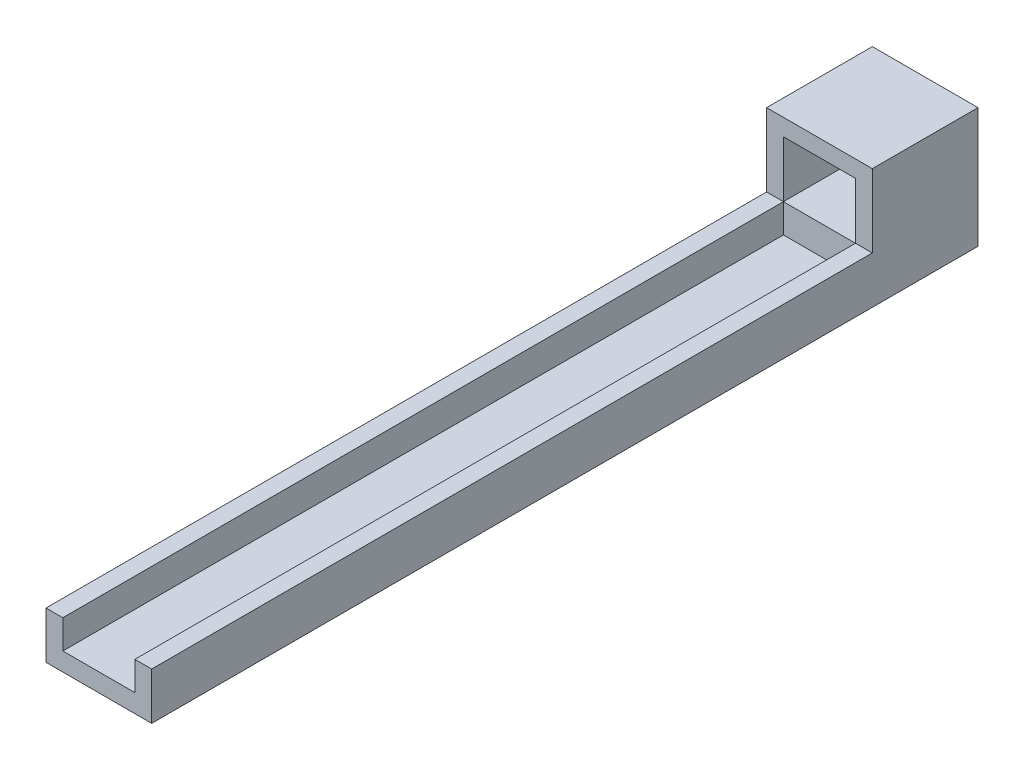
ISO-10303-21;
HEADER;
FILE_DESCRIPTION(('STEP AP214'),'2;1');
FILE_NAME('part.step','',(''),(''),'','','');
FILE_SCHEMA(('AUTOMOTIVE_DESIGN { 1 0 10303 214 1 1 1 1 }'));
ENDSEC;
DATA;
#1=APPLICATION_CONTEXT('core data for automotive mechanical design processes');
#2=APPLICATION_PROTOCOL_DEFINITION('international standard','automotive_design',2000,#1);
#3=PRODUCT_CONTEXT('',#1,'mechanical');
#4=PRODUCT('Part','Part','',(#3));
#5=PRODUCT_RELATED_PRODUCT_CATEGORY('part','',(#4));
#6=PRODUCT_DEFINITION_FORMATION('','',#4);
#7=PRODUCT_DEFINITION_CONTEXT('part definition',#1,'design');
#8=PRODUCT_DEFINITION('design','',#6,#7);
#9=PRODUCT_DEFINITION_SHAPE('','',#8);
#10=(LENGTH_UNIT() NAMED_UNIT(*) SI_UNIT(.MILLI.,.METRE.));
#11=(NAMED_UNIT(*) PLANE_ANGLE_UNIT() SI_UNIT($,.RADIAN.));
#12=(NAMED_UNIT(*) SI_UNIT($,.STERADIAN.) SOLID_ANGLE_UNIT());
#13=UNCERTAINTY_MEASURE_WITH_UNIT(LENGTH_MEASURE(1.E-05),#10,'distance_accuracy_value','');
#14=(GEOMETRIC_REPRESENTATION_CONTEXT(3) GLOBAL_UNCERTAINTY_ASSIGNED_CONTEXT((#13)) GLOBAL_UNIT_ASSIGNED_CONTEXT((#10,
#11,#12)) REPRESENTATION_CONTEXT('',''));
#15=CARTESIAN_POINT('',(0.,0.,0.));
#16=DIRECTION('',(0.,0.,1.));
#17=DIRECTION('',(1.,0.,0.));
#18=AXIS2_PLACEMENT_3D('',#15,#16,#17);
#19=CARTESIAN_POINT('',(-22.1134214303808,-9.7596153846154,22.));
#20=DIRECTION('',(0.,1.,0.));
#21=DIRECTION('',(0.,0.,1.));
#22=AXIS2_PLACEMENT_3D('',#19,#20,#21);
#23=PLANE('',#22);
#24=DIRECTION('',(0.,0.,-1.));
#25=VECTOR('',#24,1.);
#26=CARTESIAN_POINT('',(-7.11342143038084,-9.7596153846154,172.));
#27=LINE('',#26,#25);
#28=CARTESIAN_POINT('',(-7.11342143038084,-9.7596153846154,172.));
#29=VERTEX_POINT('',#28);
#30=CARTESIAN_POINT('',(-7.11342143038084,-9.7596153846154,22.));
#31=VERTEX_POINT('',#30);
#32=EDGE_CURVE('E136',#29,#31,#27,.T.);
#33=ORIENTED_EDGE('',*,*,#32,.F.);
#34=DIRECTION('',(-1.,0.,0.));
#35=VECTOR('',#34,1.);
#36=CARTESIAN_POINT('',(-3.61342143038084,-9.7596153846154,172.));
#37=LINE('',#36,#35);
#38=CARTESIAN_POINT('',(-3.61342143038084,-9.7596153846154,172.));
#39=VERTEX_POINT('',#38);
#40=EDGE_CURVE('E168',#39,#29,#37,.T.);
#41=ORIENTED_EDGE('',*,*,#40,.F.);
#42=DIRECTION('',(0.,0.,-1.));
#43=VECTOR('',#42,1.);
#44=CARTESIAN_POINT('',(-3.61342143038084,-9.7596153846154,172.));
#45=LINE('',#44,#43);
#46=CARTESIAN_POINT('',(-3.61342143038085,-9.7596153846154,22.));
#47=VERTEX_POINT('',#46);
#48=EDGE_CURVE('E180',#39,#47,#45,.T.);
#49=ORIENTED_EDGE('',*,*,#48,.T.);
#50=DIRECTION('',(-1.,0.,0.));
#51=VECTOR('',#50,1.);
#52=CARTESIAN_POINT('',(-3.61342143038084,-9.7596153846154,22.));
#53=LINE('',#52,#51);
#54=EDGE_CURVE('E42',#47,#31,#53,.T.);
#55=ORIENTED_EDGE('',*,*,#54,.T.);
#56=EDGE_LOOP('',(#33,#41,#49,#55));
#57=FACE_BOUND('',#56,.T.);
#58=ADVANCED_FACE('F32',(#57),#23,.T.);
#59=DIRECTION('',(0.,0.,1.));
#60=VECTOR('',#59,1.);
#61=CARTESIAN_POINT('',(-22.1134214303808,-9.7596153846154,172.));
#62=LINE('',#61,#60);
#63=CARTESIAN_POINT('',(-22.1134214303808,-9.7596153846154,22.));
#64=VERTEX_POINT('',#63);
#65=CARTESIAN_POINT('',(-22.1134214303808,-9.7596153846154,172.));
#66=VERTEX_POINT('',#65);
#67=EDGE_CURVE('E149',#64,#66,#62,.T.);
#68=ORIENTED_EDGE('',*,*,#67,.F.);
#69=CARTESIAN_POINT('',(-25.6134214303808,-9.7596153846154,22.));
#70=VERTEX_POINT('',#69);
#71=EDGE_CURVE('E11',#64,#70,#53,.T.);
#72=ORIENTED_EDGE('',*,*,#71,.T.);
#73=DIRECTION('',(0.,0.,-1.));
#74=VECTOR('',#73,1.);
#75=CARTESIAN_POINT('',(-25.6134214303808,-9.7596153846154,172.));
#76=LINE('',#75,#74);
#77=CARTESIAN_POINT('',(-25.6134214303808,-9.7596153846154,172.));
#78=VERTEX_POINT('',#77);
#79=EDGE_CURVE('E176',#78,#70,#76,.T.);
#80=ORIENTED_EDGE('',*,*,#79,.F.);
#81=EDGE_CURVE('E167',#66,#78,#37,.T.);
#82=ORIENTED_EDGE('',*,*,#81,.F.);
#83=EDGE_LOOP('',(#68,#72,#80,#82));
#84=FACE_BOUND('',#83,.T.);
#85=ADVANCED_FACE('F266',(#84),#23,.T.);
#86=CARTESIAN_POINT('',(0.,0.,22.));
#87=DIRECTION('',(0.,0.,1.));
#88=DIRECTION('',(1.,0.,0.));
#89=AXIS2_PLACEMENT_3D('',#86,#87,#88);
#90=PLANE('',#89);
#91=ORIENTED_EDGE('',*,*,#54,.F.);
#92=DIRECTION('',(0.,1.,0.));
#93=VECTOR('',#92,1.);
#94=CARTESIAN_POINT('',(-3.61342143038085,5.4403846153846,22.));
#95=LINE('',#94,#93);
#96=CARTESIAN_POINT('',(-3.61342143038085,5.4403846153846,22.));
#97=VERTEX_POINT('',#96);
#98=EDGE_CURVE('E216',#47,#97,#95,.T.);
#99=ORIENTED_EDGE('',*,*,#98,.T.);
#100=DIRECTION('',(-1.,0.,0.));
#101=VECTOR('',#100,1.);
#102=CARTESIAN_POINT('',(-25.6134214303808,5.4403846153846,22.));
#103=LINE('',#102,#101);
#104=CARTESIAN_POINT('',(-25.6134214303808,5.4403846153846,22.));
#105=VERTEX_POINT('',#104);
#106=EDGE_CURVE('E219',#97,#105,#103,.T.);
#107=ORIENTED_EDGE('',*,*,#106,.T.);
#108=DIRECTION('',(0.,-1.,0.));
#109=VECTOR('',#108,1.);
#110=CARTESIAN_POINT('',(-25.6134214303808,5.4403846153846,22.));
#111=LINE('',#110,#109);
#112=EDGE_CURVE('E214',#105,#70,#111,.T.);
#113=ORIENTED_EDGE('',*,*,#112,.T.);
#114=ORIENTED_EDGE('',*,*,#71,.F.);
#115=DIRECTION('',(0.,-1.,0.));
#116=VECTOR('',#115,1.);
#117=CARTESIAN_POINT('',(-22.1134214303808,1.9403846153846,22.));
#118=LINE('',#117,#116);
#119=CARTESIAN_POINT('',(-22.1134214303808,1.9403846153846,22.));
#120=VERTEX_POINT('',#119);
#121=EDGE_CURVE('E184',#120,#64,#118,.T.);
#122=ORIENTED_EDGE('',*,*,#121,.F.);
#123=DIRECTION('',(-1.,0.,0.));
#124=VECTOR('',#123,1.);
#125=CARTESIAN_POINT('',(-22.1134214303808,1.9403846153846,22.));
#126=LINE('',#125,#124);
#127=CARTESIAN_POINT('',(-7.11342143038085,1.9403846153846,22.));
#128=VERTEX_POINT('',#127);
#129=EDGE_CURVE('E191',#128,#120,#126,.T.);
#130=ORIENTED_EDGE('',*,*,#129,.F.);
#131=DIRECTION('',(0.,1.,0.));
#132=VECTOR('',#131,1.);
#133=CARTESIAN_POINT('',(-7.11342143038085,1.9403846153846,22.));
#134=LINE('',#133,#132);
#135=EDGE_CURVE('E187',#31,#128,#134,.T.);
#136=ORIENTED_EDGE('',*,*,#135,.F.);
#137=EDGE_LOOP('',(#91,#99,#107,#113,#114,#122,#130,#136));
#138=FACE_BOUND('',#137,.T.);
#139=ADVANCED_FACE('F256',(#138),#90,.T.);
#140=CARTESIAN_POINT('',(0.,0.,0.));
#141=DIRECTION('',(0.,0.,1.));
#142=DIRECTION('',(1.,0.,0.));
#143=AXIS2_PLACEMENT_3D('',#140,#141,#142);
#144=PLANE('',#143);
#145=DIRECTION('',(0.,-1.,0.));
#146=VECTOR('',#145,1.);
#147=CARTESIAN_POINT('',(-25.6134214303808,5.4403846153846,0.));
#148=LINE('',#147,#146);
#149=CARTESIAN_POINT('',(-25.6134214303808,5.4403846153846,0.));
#150=VERTEX_POINT('',#149);
#151=CARTESIAN_POINT('',(-25.6134214303808,-19.5596153846154,0.));
#152=VERTEX_POINT('',#151);
#153=EDGE_CURVE('E213',#150,#152,#148,.T.);
#154=ORIENTED_EDGE('',*,*,#153,.F.);
#155=DIRECTION('',(-1.,0.,0.));
#156=VECTOR('',#155,1.);
#157=CARTESIAN_POINT('',(-25.6134214303808,5.4403846153846,0.));
#158=LINE('',#157,#156);
#159=CARTESIAN_POINT('',(-3.61342143038085,5.4403846153846,0.));
#160=VERTEX_POINT('',#159);
#161=EDGE_CURVE('E217',#160,#150,#158,.T.);
#162=ORIENTED_EDGE('',*,*,#161,.F.);
#163=DIRECTION('',(0.,1.,0.));
#164=VECTOR('',#163,1.);
#165=CARTESIAN_POINT('',(-3.61342143038085,5.4403846153846,0.));
#166=LINE('',#165,#164);
#167=CARTESIAN_POINT('',(-3.61342143038084,-19.5596153846154,0.));
#168=VERTEX_POINT('',#167);
#169=EDGE_CURVE('E226',#168,#160,#166,.T.);
#170=ORIENTED_EDGE('',*,*,#169,.F.);
#171=DIRECTION('',(1.,0.,0.));
#172=VECTOR('',#171,1.);
#173=CARTESIAN_POINT('',(-25.6134214303808,-19.5596153846154,0.));
#174=LINE('',#173,#172);
#175=EDGE_CURVE('E224',#152,#168,#174,.T.);
#176=ORIENTED_EDGE('',*,*,#175,.F.);
#177=EDGE_LOOP('',(#154,#162,#170,#176));
#178=FACE_BOUND('',#177,.T.);
#179=DIRECTION('',(0.,-1.,0.));
#180=VECTOR('',#179,1.);
#181=CARTESIAN_POINT('',(-22.1134214303808,1.9403846153846,0.));
#182=LINE('',#181,#180);
#183=CARTESIAN_POINT('',(-22.1134214303808,1.9403846153846,0.));
#184=VERTEX_POINT('',#183);
#185=CARTESIAN_POINT('',(-22.1134214303808,-9.7596153846154,0.));
#186=VERTEX_POINT('',#185);
#187=EDGE_CURVE('E183',#184,#186,#182,.T.);
#188=ORIENTED_EDGE('',*,*,#187,.T.);
#189=DIRECTION('',(1.,0.,0.));
#190=VECTOR('',#189,1.);
#191=CARTESIAN_POINT('',(-22.1134214303808,-9.7596153846154,0.));
#192=LINE('',#191,#190);
#193=CARTESIAN_POINT('',(-7.11342143038085,-9.7596153846154,0.));
#194=VERTEX_POINT('',#193);
#195=EDGE_CURVE('E196',#186,#194,#192,.T.);
#196=ORIENTED_EDGE('',*,*,#195,.T.);
#197=DIRECTION('',(0.,1.,0.));
#198=VECTOR('',#197,1.);
#199=CARTESIAN_POINT('',(-7.11342143038085,1.9403846153846,0.));
#200=LINE('',#199,#198);
#201=CARTESIAN_POINT('',(-7.11342143038085,1.9403846153846,0.));
#202=VERTEX_POINT('',#201);
#203=EDGE_CURVE('E199',#194,#202,#200,.T.);
#204=ORIENTED_EDGE('',*,*,#203,.T.);
#205=DIRECTION('',(-1.,0.,0.));
#206=VECTOR('',#205,1.);
#207=CARTESIAN_POINT('',(-22.1134214303808,1.9403846153846,0.));
#208=LINE('',#207,#206);
#209=EDGE_CURVE('E188',#202,#184,#208,.T.);
#210=ORIENTED_EDGE('',*,*,#209,.T.);
#211=EDGE_LOOP('',(#188,#196,#204,#210));
#212=FACE_BOUND('',#211,.T.);
#213=ADVANCED_FACE('F249',(#178,#212),#144,.F.);
#214=CARTESIAN_POINT('',(-25.6134214303808,5.4403846153846,22.));
#215=DIRECTION('',(1.,0.,0.));
#216=DIRECTION('',(0.,1.,0.));
#217=AXIS2_PLACEMENT_3D('',#214,#215,#216);
#218=PLANE('',#217);
#219=ORIENTED_EDGE('',*,*,#153,.T.);
#220=DIRECTION('',(0.,0.,-1.));
#221=VECTOR('',#220,1.);
#222=CARTESIAN_POINT('',(-25.6134214303808,-19.5596153846154,22.));
#223=LINE('',#222,#221);
#224=CARTESIAN_POINT('',(-25.6134214303808,-19.5596153846154,172.));
#225=VERTEX_POINT('',#224);
#226=EDGE_CURVE('E36',#225,#152,#223,.T.);
#227=ORIENTED_EDGE('',*,*,#226,.F.);
#228=DIRECTION('',(0.,-1.,0.));
#229=VECTOR('',#228,1.);
#230=CARTESIAN_POINT('',(-25.6134214303808,-9.7596153846154,172.));
#231=LINE('',#230,#229);
#232=EDGE_CURVE('E171',#78,#225,#231,.T.);
#233=ORIENTED_EDGE('',*,*,#232,.F.);
#234=ORIENTED_EDGE('',*,*,#79,.T.);
#235=ORIENTED_EDGE('',*,*,#112,.F.);
#236=DIRECTION('',(0.,0.,-1.));
#237=VECTOR('',#236,1.);
#238=CARTESIAN_POINT('',(-25.6134214303808,5.4403846153846,22.));
#239=LINE('',#238,#237);
#240=EDGE_CURVE('E221',#105,#150,#239,.T.);
#241=ORIENTED_EDGE('',*,*,#240,.T.);
#242=EDGE_LOOP('',(#219,#227,#233,#234,#235,#241));
#243=FACE_BOUND('',#242,.T.);
#244=ADVANCED_FACE('F34',(#243),#218,.F.);
#245=CARTESIAN_POINT('',(-25.6134214303808,-19.5596153846154,22.));
#246=DIRECTION('',(0.,1.,0.));
#247=DIRECTION('',(0.,0.,1.));
#248=AXIS2_PLACEMENT_3D('',#245,#246,#247);
#249=PLANE('',#248);
#250=ORIENTED_EDGE('',*,*,#175,.T.);
#251=DIRECTION('',(0.,0.,-1.));
#252=VECTOR('',#251,1.);
#253=CARTESIAN_POINT('',(-3.61342143038084,-19.5596153846154,22.));
#254=LINE('',#253,#252);
#255=CARTESIAN_POINT('',(-3.61342143038085,-19.5596153846154,172.));
#256=VERTEX_POINT('',#255);
#257=EDGE_CURVE('E233',#256,#168,#254,.T.);
#258=ORIENTED_EDGE('',*,*,#257,.F.);
#259=DIRECTION('',(1.,0.,0.));
#260=VECTOR('',#259,1.);
#261=CARTESIAN_POINT('',(-3.61342143038085,-19.5596153846154,172.));
#262=LINE('',#261,#260);
#263=EDGE_CURVE('E174',#225,#256,#262,.T.);
#264=ORIENTED_EDGE('',*,*,#263,.F.);
#265=ORIENTED_EDGE('',*,*,#226,.T.);
#266=EDGE_LOOP('',(#250,#258,#264,#265));
#267=FACE_BOUND('',#266,.T.);
#268=ADVANCED_FACE('F241',(#267),#249,.F.);
#269=CARTESIAN_POINT('',(-3.61342143038085,5.4403846153846,22.));
#270=DIRECTION('',(-1.,0.,0.));
#271=DIRECTION('',(0.,-1.,0.));
#272=AXIS2_PLACEMENT_3D('',#269,#270,#271);
#273=PLANE('',#272);
#274=ORIENTED_EDGE('',*,*,#169,.T.);
#275=DIRECTION('',(0.,0.,-1.));
#276=VECTOR('',#275,1.);
#277=CARTESIAN_POINT('',(-3.61342143038085,5.4403846153846,22.));
#278=LINE('',#277,#276);
#279=EDGE_CURVE('E231',#97,#160,#278,.T.);
#280=ORIENTED_EDGE('',*,*,#279,.F.);
#281=ORIENTED_EDGE('',*,*,#98,.F.);
#282=ORIENTED_EDGE('',*,*,#48,.F.);
#283=DIRECTION('',(0.,1.,0.));
#284=VECTOR('',#283,1.);
#285=CARTESIAN_POINT('',(-3.61342143038084,-9.7596153846154,172.));
#286=LINE('',#285,#284);
#287=EDGE_CURVE('E164',#256,#39,#286,.T.);
#288=ORIENTED_EDGE('',*,*,#287,.F.);
#289=ORIENTED_EDGE('',*,*,#257,.T.);
#290=EDGE_LOOP('',(#274,#280,#281,#282,#288,#289));
#291=FACE_BOUND('',#290,.T.);
#292=ADVANCED_FACE('F252',(#291),#273,.F.);
#293=CARTESIAN_POINT('',(-25.6134214303808,5.4403846153846,22.));
#294=DIRECTION('',(0.,-1.,0.));
#295=DIRECTION('',(0.,0.,-1.));
#296=AXIS2_PLACEMENT_3D('',#293,#294,#295);
#297=PLANE('',#296);
#298=ORIENTED_EDGE('',*,*,#161,.T.);
#299=ORIENTED_EDGE('',*,*,#240,.F.);
#300=ORIENTED_EDGE('',*,*,#106,.F.);
#301=ORIENTED_EDGE('',*,*,#279,.T.);
#302=EDGE_LOOP('',(#298,#299,#300,#301));
#303=FACE_BOUND('',#302,.T.);
#304=ADVANCED_FACE('F255',(#303),#297,.F.);
#305=CARTESIAN_POINT('',(-22.1134214303808,1.9403846153846,22.));
#306=DIRECTION('',(1.,0.,0.));
#307=DIRECTION('',(0.,0.,-1.));
#308=AXIS2_PLACEMENT_3D('',#305,#306,#307);
#309=PLANE('',#308);
#310=ORIENTED_EDGE('',*,*,#187,.F.);
#311=DIRECTION('',(0.,0.,-1.));
#312=VECTOR('',#311,1.);
#313=CARTESIAN_POINT('',(-22.1134214303808,1.9403846153846,22.));
#314=LINE('',#313,#312);
#315=EDGE_CURVE('E193',#120,#184,#314,.T.);
#316=ORIENTED_EDGE('',*,*,#315,.F.);
#317=ORIENTED_EDGE('',*,*,#121,.T.);
#318=DIRECTION('',(0.,0.,-1.));
#319=VECTOR('',#318,1.);
#320=CARTESIAN_POINT('',(-22.1134214303808,-9.7596153846154,22.));
#321=LINE('',#320,#319);
#322=EDGE_CURVE('E210',#64,#186,#321,.T.);
#323=ORIENTED_EDGE('',*,*,#322,.T.);
#324=EDGE_LOOP('',(#310,#316,#317,#323));
#325=FACE_BOUND('',#324,.T.);
#326=ADVANCED_FACE('F272',(#325),#309,.T.);
#327=DIRECTION('',(-1.,0.,0.));
#328=VECTOR('',#327,1.);
#329=CARTESIAN_POINT('',(-7.11342143038084,-9.7596153846154,22.));
#330=LINE('',#329,#328);
#331=EDGE_CURVE('E151',#31,#64,#330,.T.);
#332=ORIENTED_EDGE('',*,*,#331,.F.);
#333=DIRECTION('',(0.,0.,-1.));
#334=VECTOR('',#333,1.);
#335=CARTESIAN_POINT('',(-7.11342143038085,-9.7596153846154,22.));
#336=LINE('',#335,#334);
#337=EDGE_CURVE('E208',#31,#194,#336,.T.);
#338=ORIENTED_EDGE('',*,*,#337,.T.);
#339=ORIENTED_EDGE('',*,*,#195,.F.);
#340=ORIENTED_EDGE('',*,*,#322,.F.);
#341=EDGE_LOOP('',(#332,#338,#339,#340));
#342=FACE_BOUND('',#341,.T.);
#343=ADVANCED_FACE('F274',(#342),#23,.T.);
#344=CARTESIAN_POINT('',(-7.11342143038085,1.9403846153846,22.));
#345=DIRECTION('',(-1.,0.,0.));
#346=DIRECTION('',(0.,0.,1.));
#347=AXIS2_PLACEMENT_3D('',#344,#345,#346);
#348=PLANE('',#347);
#349=ORIENTED_EDGE('',*,*,#203,.F.);
#350=ORIENTED_EDGE('',*,*,#337,.F.);
#351=ORIENTED_EDGE('',*,*,#135,.T.);
#352=DIRECTION('',(0.,0.,-1.));
#353=VECTOR('',#352,1.);
#354=CARTESIAN_POINT('',(-7.11342143038085,1.9403846153846,22.));
#355=LINE('',#354,#353);
#356=EDGE_CURVE('E206',#128,#202,#355,.T.);
#357=ORIENTED_EDGE('',*,*,#356,.T.);
#358=EDGE_LOOP('',(#349,#350,#351,#357));
#359=FACE_BOUND('',#358,.T.);
#360=ADVANCED_FACE('F281',(#359),#348,.T.);
#361=CARTESIAN_POINT('',(-22.1134214303808,1.9403846153846,22.));
#362=DIRECTION('',(0.,-1.,0.));
#363=DIRECTION('',(0.,0.,-1.));
#364=AXIS2_PLACEMENT_3D('',#361,#362,#363);
#365=PLANE('',#364);
#366=ORIENTED_EDGE('',*,*,#209,.F.);
#367=ORIENTED_EDGE('',*,*,#356,.F.);
#368=ORIENTED_EDGE('',*,*,#129,.T.);
#369=ORIENTED_EDGE('',*,*,#315,.T.);
#370=EDGE_LOOP('',(#366,#367,#368,#369));
#371=FACE_BOUND('',#370,.T.);
#372=ADVANCED_FACE('F279',(#371),#365,.T.);
#373=CARTESIAN_POINT('',(0.,0.,172.));
#374=DIRECTION('',(0.,0.,-1.));
#375=DIRECTION('',(-1.,0.,0.));
#376=AXIS2_PLACEMENT_3D('',#373,#374,#375);
#377=PLANE('',#376);
#378=ORIENTED_EDGE('',*,*,#40,.T.);
#379=DIRECTION('',(0.,1.,0.));
#380=VECTOR('',#379,1.);
#381=CARTESIAN_POINT('',(-7.11342143038084,-15.7596153846154,172.));
#382=LINE('',#381,#380);
#383=CARTESIAN_POINT('',(-7.11342143038084,-15.7596153846154,172.));
#384=VERTEX_POINT('',#383);
#385=EDGE_CURVE('E158',#384,#29,#382,.T.);
#386=ORIENTED_EDGE('',*,*,#385,.F.);
#387=DIRECTION('',(1.,0.,0.));
#388=VECTOR('',#387,1.);
#389=CARTESIAN_POINT('',(-7.11342143038084,-15.7596153846154,172.));
#390=LINE('',#389,#388);
#391=CARTESIAN_POINT('',(-22.1134214303808,-15.7596153846154,172.));
#392=VERTEX_POINT('',#391);
#393=EDGE_CURVE('E141',#392,#384,#390,.T.);
#394=ORIENTED_EDGE('',*,*,#393,.F.);
#395=DIRECTION('',(0.,1.,0.));
#396=VECTOR('',#395,1.);
#397=CARTESIAN_POINT('',(-22.1134214303808,-15.7596153846154,172.));
#398=LINE('',#397,#396);
#399=EDGE_CURVE('E160',#392,#66,#398,.T.);
#400=ORIENTED_EDGE('',*,*,#399,.T.);
#401=ORIENTED_EDGE('',*,*,#81,.T.);
#402=ORIENTED_EDGE('',*,*,#232,.T.);
#403=ORIENTED_EDGE('',*,*,#263,.T.);
#404=ORIENTED_EDGE('',*,*,#287,.T.);
#405=EDGE_LOOP('',(#378,#386,#394,#400,#401,#402,#403,#404));
#406=FACE_BOUND('',#405,.T.);
#407=ADVANCED_FACE('F261',(#406),#377,.F.);
#408=CARTESIAN_POINT('',(-7.11342143038084,-15.7596153846154,172.));
#409=DIRECTION('',(1.,0.,0.));
#410=DIRECTION('',(0.,0.,-1.));
#411=AXIS2_PLACEMENT_3D('',#408,#409,#410);
#412=PLANE('',#411);
#413=ORIENTED_EDGE('',*,*,#32,.T.);
#414=DIRECTION('',(0.,1.,0.));
#415=VECTOR('',#414,1.);
#416=CARTESIAN_POINT('',(-7.11342143038084,-15.7596153846154,22.));
#417=LINE('',#416,#415);
#418=CARTESIAN_POINT('',(-7.11342143038084,-15.7596153846154,22.));
#419=VERTEX_POINT('',#418);
#420=EDGE_CURVE('E130',#419,#31,#417,.T.);
#421=ORIENTED_EDGE('',*,*,#420,.F.);
#422=DIRECTION('',(0.,0.,-1.));
#423=VECTOR('',#422,1.);
#424=CARTESIAN_POINT('',(-7.11342143038084,-15.7596153846154,172.));
#425=LINE('',#424,#423);
#426=EDGE_CURVE('E134',#384,#419,#425,.T.);
#427=ORIENTED_EDGE('',*,*,#426,.F.);
#428=ORIENTED_EDGE('',*,*,#385,.T.);
#429=EDGE_LOOP('',(#413,#421,#427,#428));
#430=FACE_BOUND('',#429,.T.);
#431=ADVANCED_FACE('F132',(#430),#412,.F.);
#432=CARTESIAN_POINT('',(-22.1134214303808,-15.7596153846154,172.));
#433=DIRECTION('',(-1.,0.,0.));
#434=DIRECTION('',(0.,0.,1.));
#435=AXIS2_PLACEMENT_3D('',#432,#433,#434);
#436=PLANE('',#435);
#437=ORIENTED_EDGE('',*,*,#67,.T.);
#438=ORIENTED_EDGE('',*,*,#399,.F.);
#439=DIRECTION('',(0.,0.,1.));
#440=VECTOR('',#439,1.);
#441=CARTESIAN_POINT('',(-22.1134214303808,-15.7596153846154,172.));
#442=LINE('',#441,#440);
#443=CARTESIAN_POINT('',(-22.1134214303808,-15.7596153846154,22.));
#444=VERTEX_POINT('',#443);
#445=EDGE_CURVE('E49',#444,#392,#442,.T.);
#446=ORIENTED_EDGE('',*,*,#445,.F.);
#447=DIRECTION('',(0.,1.,0.));
#448=VECTOR('',#447,1.);
#449=CARTESIAN_POINT('',(-22.1134214303808,-15.7596153846154,22.));
#450=LINE('',#449,#448);
#451=EDGE_CURVE('E140',#444,#64,#450,.T.);
#452=ORIENTED_EDGE('',*,*,#451,.T.);
#453=EDGE_LOOP('',(#437,#438,#446,#452));
#454=FACE_BOUND('',#453,.T.);
#455=ADVANCED_FACE('F369',(#454),#436,.F.);
#456=CARTESIAN_POINT('',(-7.11342143038084,-15.7596153846154,22.));
#457=DIRECTION('',(0.,0.,-1.));
#458=DIRECTION('',(-1.,0.,0.));
#459=AXIS2_PLACEMENT_3D('',#456,#457,#458);
#460=PLANE('',#459);
#461=ORIENTED_EDGE('',*,*,#331,.T.);
#462=ORIENTED_EDGE('',*,*,#451,.F.);
#463=DIRECTION('',(-1.,0.,0.));
#464=VECTOR('',#463,1.);
#465=CARTESIAN_POINT('',(-7.11342143038084,-15.7596153846154,22.));
#466=LINE('',#465,#464);
#467=EDGE_CURVE('E143',#419,#444,#466,.T.);
#468=ORIENTED_EDGE('',*,*,#467,.F.);
#469=ORIENTED_EDGE('',*,*,#420,.T.);
#470=EDGE_LOOP('',(#461,#462,#468,#469));
#471=FACE_BOUND('',#470,.T.);
#472=ADVANCED_FACE('F144',(#471),#460,.F.);
#473=CARTESIAN_POINT('',(0.,-15.7596153846154,0.));
#474=DIRECTION('',(0.,1.,0.));
#475=DIRECTION('',(0.,0.,1.));
#476=AXIS2_PLACEMENT_3D('',#473,#474,#475);
#477=PLANE('',#476);
#478=ORIENTED_EDGE('',*,*,#426,.T.);
#479=ORIENTED_EDGE('',*,*,#467,.T.);
#480=ORIENTED_EDGE('',*,*,#445,.T.);
#481=ORIENTED_EDGE('',*,*,#393,.T.);
#482=EDGE_LOOP('',(#478,#479,#480,#481));
#483=FACE_BOUND('',#482,.T.);
#484=ADVANCED_FACE('F146',(#483),#477,.T.);
#485=CLOSED_SHELL('',(#58,#85,#139,#213,#244,#268,#292,#304,#326,#343,#360,#372,#407,#431,#455,
#472,#484));
#486=MANIFOLD_SOLID_BREP('B2',#485);
#487=ADVANCED_BREP_SHAPE_REPRESENTATION('',(#18,#486),#14);
#488=SHAPE_DEFINITION_REPRESENTATION(#9,#487);
ENDSEC;
END-ISO-10303-21;
